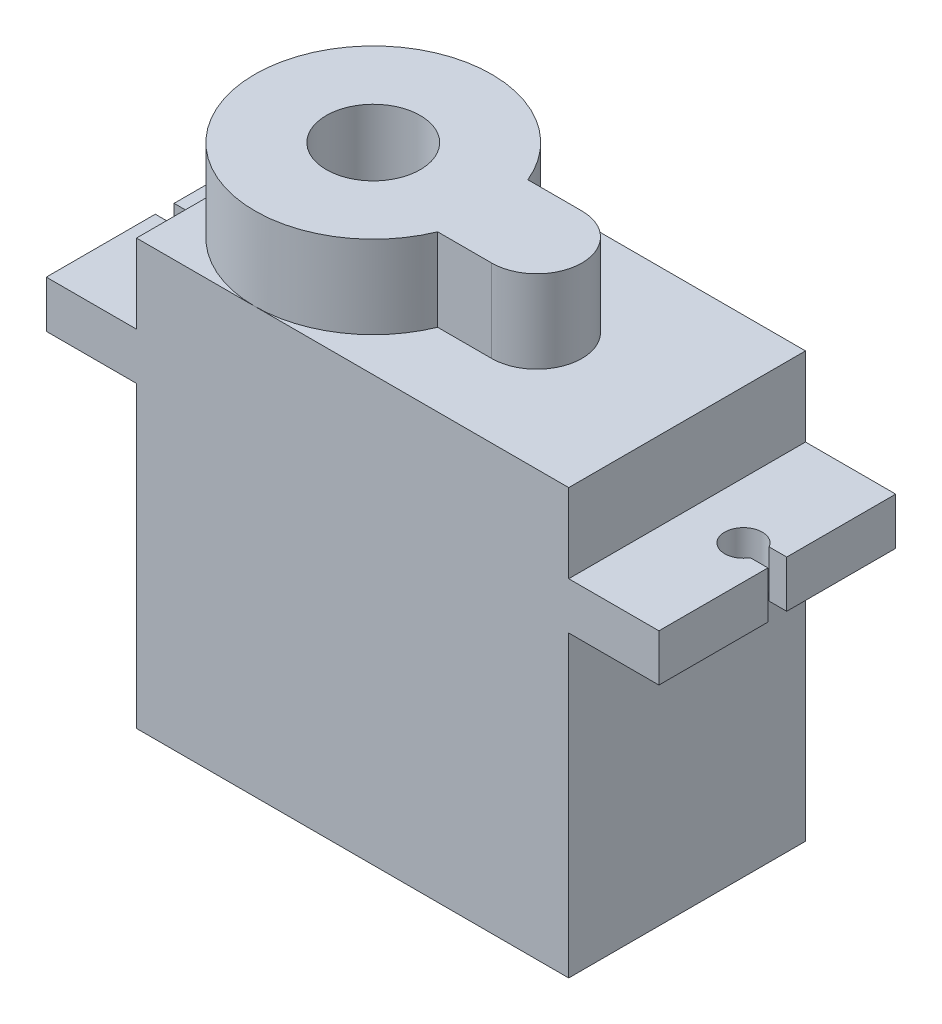
ISO-10303-21;
HEADER;
FILE_DESCRIPTION(('STEP AP214'),'2;1');
FILE_NAME('part.step','',(''),(''),'','','');
FILE_SCHEMA(('AUTOMOTIVE_DESIGN { 1 0 10303 214 1 1 1 1 }'));
ENDSEC;
DATA;
#1=APPLICATION_CONTEXT('core data for automotive mechanical design processes');
#2=APPLICATION_PROTOCOL_DEFINITION('international standard','automotive_design',2000,#1);
#3=PRODUCT_CONTEXT('',#1,'mechanical');
#4=PRODUCT('Part','Part','',(#3));
#5=PRODUCT_RELATED_PRODUCT_CATEGORY('part','',(#4));
#6=PRODUCT_DEFINITION_FORMATION('','',#4);
#7=PRODUCT_DEFINITION_CONTEXT('part definition',#1,'design');
#8=PRODUCT_DEFINITION('design','',#6,#7);
#9=PRODUCT_DEFINITION_SHAPE('','',#8);
#10=(LENGTH_UNIT() NAMED_UNIT(*) SI_UNIT(.MILLI.,.METRE.));
#11=(NAMED_UNIT(*) PLANE_ANGLE_UNIT() SI_UNIT($,.RADIAN.));
#12=(NAMED_UNIT(*) SI_UNIT($,.STERADIAN.) SOLID_ANGLE_UNIT());
#13=UNCERTAINTY_MEASURE_WITH_UNIT(LENGTH_MEASURE(1.E-05),#10,'distance_accuracy_value','');
#14=(GEOMETRIC_REPRESENTATION_CONTEXT(3) GLOBAL_UNCERTAINTY_ASSIGNED_CONTEXT((#13)) GLOBAL_UNIT_ASSIGNED_CONTEXT((#10,
#11,#12)) REPRESENTATION_CONTEXT('',''));
#15=CARTESIAN_POINT('',(0.,0.,0.));
#16=DIRECTION('',(0.,0.,1.));
#17=DIRECTION('',(1.,0.,0.));
#18=AXIS2_PLACEMENT_3D('',#15,#16,#17);
#19=CARTESIAN_POINT('',(-11.5,22.6,12.6));
#20=DIRECTION('',(0.,1.,0.));
#21=DIRECTION('',(0.,0.,1.));
#22=AXIS2_PLACEMENT_3D('',#19,#20,#21);
#23=PLANE('',#22);
#24=CARTESIAN_POINT('',(-5.2,22.6,6.3));
#25=DIRECTION('',(0.,1.,0.));
#26=DIRECTION('',(0.,0.,1.));
#27=AXIS2_PLACEMENT_3D('',#24,#25,#26);
#28=CIRCLE('',#27,6.3);
#29=CARTESIAN_POINT('',(0.62494635168428,22.6,3.9));
#30=VERTEX_POINT('',#29);
#31=CARTESIAN_POINT('',(-5.2,22.6,0.));
#32=VERTEX_POINT('',#31);
#33=EDGE_CURVE('E61',#30,#32,#28,.T.);
#34=ORIENTED_EDGE('',*,*,#33,.F.);
#35=DIRECTION('',(1.,0.,0.));
#36=VECTOR('',#35,1.);
#37=CARTESIAN_POINT('',(0.,22.6,3.9));
#38=LINE('',#37,#36);
#39=CARTESIAN_POINT('',(3.49999999999999,22.6,3.9));
#40=VERTEX_POINT('',#39);
#41=EDGE_CURVE('E72',#30,#40,#38,.T.);
#42=ORIENTED_EDGE('',*,*,#41,.T.);
#43=CARTESIAN_POINT('',(3.49999999999999,22.6,6.3));
#44=DIRECTION('',(0.,1.,0.));
#45=DIRECTION('',(0.,0.,1.));
#46=AXIS2_PLACEMENT_3D('',#43,#44,#45);
#47=CIRCLE('',#46,2.4);
#48=CARTESIAN_POINT('',(3.49999999999999,22.6,8.7));
#49=VERTEX_POINT('',#48);
#50=EDGE_CURVE('E458',#49,#40,#47,.T.);
#51=ORIENTED_EDGE('',*,*,#50,.F.);
#52=DIRECTION('',(1.,0.,0.));
#53=VECTOR('',#52,1.);
#54=CARTESIAN_POINT('',(0.,22.6,8.7));
#55=LINE('',#54,#53);
#56=CARTESIAN_POINT('',(0.62494635168428,22.6,8.7));
#57=VERTEX_POINT('',#56);
#58=EDGE_CURVE('E457',#57,#49,#55,.T.);
#59=ORIENTED_EDGE('',*,*,#58,.F.);
#60=CARTESIAN_POINT('',(-5.2,22.6,12.6));
#61=VERTEX_POINT('',#60);
#62=EDGE_CURVE('E247',#61,#57,#28,.T.);
#63=ORIENTED_EDGE('',*,*,#62,.F.);
#64=DIRECTION('',(1.,0.,0.));
#65=VECTOR('',#64,1.);
#66=CARTESIAN_POINT('',(-11.5,22.6,12.6));
#67=LINE('',#66,#65);
#68=CARTESIAN_POINT('',(11.5,22.6,12.6));
#69=VERTEX_POINT('',#68);
#70=EDGE_CURVE('E325',#61,#69,#67,.T.);
#71=ORIENTED_EDGE('',*,*,#70,.T.);
#72=DIRECTION('',(0.,0.,-1.));
#73=VECTOR('',#72,1.);
#74=CARTESIAN_POINT('',(11.5,22.6,12.6));
#75=LINE('',#74,#73);
#76=CARTESIAN_POINT('',(11.5,22.6,0.));
#77=VERTEX_POINT('',#76);
#78=EDGE_CURVE('E389',#69,#77,#75,.T.);
#79=ORIENTED_EDGE('',*,*,#78,.T.);
#80=DIRECTION('',(1.,0.,0.));
#81=VECTOR('',#80,1.);
#82=CARTESIAN_POINT('',(-11.5,22.6,0.));
#83=LINE('',#82,#81);
#84=EDGE_CURVE('E357',#32,#77,#83,.T.);
#85=ORIENTED_EDGE('',*,*,#84,.F.);
#86=EDGE_LOOP('',(#34,#42,#51,#59,#63,#71,#79,#85));
#87=FACE_BOUND('',#86,.T.);
#88=ADVANCED_FACE('F50',(#87),#23,.T.);
#89=CARTESIAN_POINT('',(-11.5,22.6,6.3));
#90=VERTEX_POINT('',#89);
#91=EDGE_CURVE('E13',#32,#90,#28,.T.);
#92=ORIENTED_EDGE('',*,*,#91,.F.);
#93=CARTESIAN_POINT('',(-11.5,22.6,0.));
#94=VERTEX_POINT('',#93);
#95=EDGE_CURVE('E358',#94,#32,#83,.T.);
#96=ORIENTED_EDGE('',*,*,#95,.F.);
#97=DIRECTION('',(0.,0.,-1.));
#98=VECTOR('',#97,1.);
#99=CARTESIAN_POINT('',(-11.5,22.6,12.6));
#100=LINE('',#99,#98);
#101=EDGE_CURVE('E395',#90,#94,#100,.T.);
#102=ORIENTED_EDGE('',*,*,#101,.F.);
#103=EDGE_LOOP('',(#92,#96,#102));
#104=FACE_BOUND('',#103,.T.);
#105=ADVANCED_FACE('F464',(#104),#23,.T.);
#106=CARTESIAN_POINT('',(-16.3,18.4,12.6));
#107=DIRECTION('',(0.,1.,0.));
#108=DIRECTION('',(0.,0.,1.));
#109=AXIS2_PLACEMENT_3D('',#106,#107,#108);
#110=PLANE('',#109);
#111=DIRECTION('',(1.,0.,0.));
#112=VECTOR('',#111,1.);
#113=CARTESIAN_POINT('',(0.,18.4,6.8));
#114=LINE('',#113,#112);
#115=CARTESIAN_POINT('',(-16.3,18.4,6.8));
#116=VERTEX_POINT('',#115);
#117=CARTESIAN_POINT('',(-15.3660254037844,18.4,6.8));
#118=VERTEX_POINT('',#117);
#119=EDGE_CURVE('E248',#116,#118,#114,.T.);
#120=ORIENTED_EDGE('',*,*,#119,.F.);
#121=DIRECTION('',(0.,0.,-1.));
#122=VECTOR('',#121,1.);
#123=CARTESIAN_POINT('',(-16.3,18.4,12.6));
#124=LINE('',#123,#122);
#125=CARTESIAN_POINT('',(-16.3,18.4,12.6));
#126=VERTEX_POINT('',#125);
#127=EDGE_CURVE('E398',#126,#116,#124,.T.);
#128=ORIENTED_EDGE('',*,*,#127,.F.);
#129=DIRECTION('',(1.,0.,0.));
#130=VECTOR('',#129,1.);
#131=CARTESIAN_POINT('',(-16.3,18.4,12.6));
#132=LINE('',#131,#130);
#133=CARTESIAN_POINT('',(-11.5,18.4,12.6));
#134=VERTEX_POINT('',#133);
#135=EDGE_CURVE('E319',#126,#134,#132,.T.);
#136=ORIENTED_EDGE('',*,*,#135,.T.);
#137=DIRECTION('',(0.,0.,-1.));
#138=VECTOR('',#137,1.);
#139=CARTESIAN_POINT('',(-11.5,18.4,12.6));
#140=LINE('',#139,#138);
#141=CARTESIAN_POINT('',(-11.5,18.4,0.));
#142=VERTEX_POINT('',#141);
#143=EDGE_CURVE('E396',#134,#142,#140,.T.);
#144=ORIENTED_EDGE('',*,*,#143,.T.);
#145=DIRECTION('',(1.,0.,0.));
#146=VECTOR('',#145,1.);
#147=CARTESIAN_POINT('',(-16.3,18.4,0.));
#148=LINE('',#147,#146);
#149=CARTESIAN_POINT('',(-16.3,18.4,0.));
#150=VERTEX_POINT('',#149);
#151=EDGE_CURVE('E351',#150,#142,#148,.T.);
#152=ORIENTED_EDGE('',*,*,#151,.F.);
#153=CARTESIAN_POINT('',(-16.3,18.4,5.8));
#154=VERTEX_POINT('',#153);
#155=EDGE_CURVE('E401',#154,#150,#124,.T.);
#156=ORIENTED_EDGE('',*,*,#155,.F.);
#157=DIRECTION('',(1.,0.,0.));
#158=VECTOR('',#157,1.);
#159=CARTESIAN_POINT('',(0.,18.4,5.8));
#160=LINE('',#159,#158);
#161=CARTESIAN_POINT('',(-15.3660254037844,18.4,5.8));
#162=VERTEX_POINT('',#161);
#163=EDGE_CURVE('E261',#154,#162,#160,.T.);
#164=ORIENTED_EDGE('',*,*,#163,.T.);
#165=CARTESIAN_POINT('',(-14.5,18.4,6.3));
#166=DIRECTION('',(0.,1.,0.));
#167=DIRECTION('',(0.,0.,1.));
#168=AXIS2_PLACEMENT_3D('',#165,#166,#167);
#169=CIRCLE('',#168,1.);
#170=EDGE_CURVE('E251',#162,#118,#169,.F.);
#171=ORIENTED_EDGE('',*,*,#170,.T.);
#172=EDGE_LOOP('',(#120,#128,#136,#144,#152,#156,#164,#171));
#173=FACE_BOUND('',#172,.T.);
#174=ADVANCED_FACE('F447',(#173),#110,.T.);
#175=CARTESIAN_POINT('',(-16.3,15.9,12.6));
#176=DIRECTION('',(-1.,0.,0.));
#177=DIRECTION('',(0.,-1.,0.));
#178=AXIS2_PLACEMENT_3D('',#175,#176,#177);
#179=PLANE('',#178);
#180=DIRECTION('',(0.,0.,-1.));
#181=VECTOR('',#180,1.);
#182=CARTESIAN_POINT('',(-16.3,15.9,12.6));
#183=LINE('',#182,#181);
#184=CARTESIAN_POINT('',(-16.3,15.9,5.8));
#185=VERTEX_POINT('',#184);
#186=CARTESIAN_POINT('',(-16.3,15.9,0.));
#187=VERTEX_POINT('',#186);
#188=EDGE_CURVE('E404',#185,#187,#183,.T.);
#189=ORIENTED_EDGE('',*,*,#188,.F.);
#190=DIRECTION('',(0.,1.,0.));
#191=VECTOR('',#190,1.);
#192=CARTESIAN_POINT('',(-16.3,15.9,5.8));
#193=LINE('',#192,#191);
#194=EDGE_CURVE('E274',#185,#154,#193,.T.);
#195=ORIENTED_EDGE('',*,*,#194,.T.);
#196=ORIENTED_EDGE('',*,*,#155,.T.);
#197=DIRECTION('',(0.,1.,0.));
#198=VECTOR('',#197,1.);
#199=CARTESIAN_POINT('',(-16.3,15.9,0.));
#200=LINE('',#199,#198);
#201=EDGE_CURVE('E348',#187,#150,#200,.T.);
#202=ORIENTED_EDGE('',*,*,#201,.F.);
#203=EDGE_LOOP('',(#189,#195,#196,#202));
#204=FACE_BOUND('',#203,.T.);
#205=ADVANCED_FACE('F443',(#204),#179,.T.);
#206=CARTESIAN_POINT('',(-11.5,15.9,12.6));
#207=DIRECTION('',(0.,-1.,0.));
#208=DIRECTION('',(0.,0.,-1.));
#209=AXIS2_PLACEMENT_3D('',#206,#207,#208);
#210=PLANE('',#209);
#211=DIRECTION('',(1.,0.,0.));
#212=VECTOR('',#211,1.);
#213=CARTESIAN_POINT('',(0.,15.9,6.8));
#214=LINE('',#213,#212);
#215=CARTESIAN_POINT('',(-16.3,15.9,6.8));
#216=VERTEX_POINT('',#215);
#217=CARTESIAN_POINT('',(-15.3660254037844,15.9,6.8));
#218=VERTEX_POINT('',#217);
#219=EDGE_CURVE('E257',#216,#218,#214,.T.);
#220=ORIENTED_EDGE('',*,*,#219,.T.);
#221=CARTESIAN_POINT('',(-14.5,15.9,6.3));
#222=DIRECTION('',(0.,1.,0.));
#223=DIRECTION('',(0.,0.,1.));
#224=AXIS2_PLACEMENT_3D('',#221,#222,#223);
#225=CIRCLE('',#224,1.);
#226=CARTESIAN_POINT('',(-15.3660254037844,15.9,5.8));
#227=VERTEX_POINT('',#226);
#228=EDGE_CURVE('E260',#227,#218,#225,.F.);
#229=ORIENTED_EDGE('',*,*,#228,.F.);
#230=DIRECTION('',(1.,0.,0.));
#231=VECTOR('',#230,1.);
#232=CARTESIAN_POINT('',(0.,15.9,5.8));
#233=LINE('',#232,#231);
#234=EDGE_CURVE('E263',#185,#227,#233,.T.);
#235=ORIENTED_EDGE('',*,*,#234,.F.);
#236=ORIENTED_EDGE('',*,*,#188,.T.);
#237=DIRECTION('',(-1.,0.,0.));
#238=VECTOR('',#237,1.);
#239=CARTESIAN_POINT('',(-11.5,15.9,0.));
#240=LINE('',#239,#238);
#241=CARTESIAN_POINT('',(-11.5,15.9,0.));
#242=VERTEX_POINT('',#241);
#243=EDGE_CURVE('E345',#242,#187,#240,.T.);
#244=ORIENTED_EDGE('',*,*,#243,.F.);
#245=DIRECTION('',(0.,0.,-1.));
#246=VECTOR('',#245,1.);
#247=CARTESIAN_POINT('',(-11.5,15.9,12.6));
#248=LINE('',#247,#246);
#249=CARTESIAN_POINT('',(-11.5,15.9,12.6));
#250=VERTEX_POINT('',#249);
#251=EDGE_CURVE('E405',#250,#242,#248,.T.);
#252=ORIENTED_EDGE('',*,*,#251,.F.);
#253=DIRECTION('',(-1.,0.,0.));
#254=VECTOR('',#253,1.);
#255=CARTESIAN_POINT('',(-11.5,15.9,12.6));
#256=LINE('',#255,#254);
#257=CARTESIAN_POINT('',(-16.3,15.9,12.6));
#258=VERTEX_POINT('',#257);
#259=EDGE_CURVE('E313',#250,#258,#256,.T.);
#260=ORIENTED_EDGE('',*,*,#259,.T.);
#261=EDGE_CURVE('E402',#258,#216,#183,.T.);
#262=ORIENTED_EDGE('',*,*,#261,.T.);
#263=EDGE_LOOP('',(#220,#229,#235,#236,#244,#252,#260,#262));
#264=FACE_BOUND('',#263,.T.);
#265=ADVANCED_FACE('F437',(#264),#210,.T.);
#266=CARTESIAN_POINT('',(16.3,15.9,12.6));
#267=DIRECTION('',(-1.,0.,0.));
#268=DIRECTION('',(0.,-1.,0.));
#269=AXIS2_PLACEMENT_3D('',#266,#267,#268);
#270=PLANE('',#269);
#271=DIRECTION('',(0.,1.,0.));
#272=VECTOR('',#271,1.);
#273=CARTESIAN_POINT('',(16.3,15.9,6.8));
#274=LINE('',#273,#272);
#275=CARTESIAN_POINT('',(16.3,15.9,6.8));
#276=VERTEX_POINT('',#275);
#277=CARTESIAN_POINT('',(16.3,18.4,6.8));
#278=VERTEX_POINT('',#277);
#279=EDGE_CURVE('E299',#276,#278,#274,.T.);
#280=ORIENTED_EDGE('',*,*,#279,.T.);
#281=DIRECTION('',(0.,0.,-1.));
#282=VECTOR('',#281,1.);
#283=CARTESIAN_POINT('',(16.3,18.4,12.6));
#284=LINE('',#283,#282);
#285=CARTESIAN_POINT('',(16.3,18.4,12.6));
#286=VERTEX_POINT('',#285);
#287=EDGE_CURVE('E382',#286,#278,#284,.T.);
#288=ORIENTED_EDGE('',*,*,#287,.F.);
#289=DIRECTION('',(0.,1.,0.));
#290=VECTOR('',#289,1.);
#291=CARTESIAN_POINT('',(16.3,15.9,12.6));
#292=LINE('',#291,#290);
#293=CARTESIAN_POINT('',(16.3,15.9,12.6));
#294=VERTEX_POINT('',#293);
#295=EDGE_CURVE('E334',#294,#286,#292,.T.);
#296=ORIENTED_EDGE('',*,*,#295,.F.);
#297=DIRECTION('',(0.,0.,-1.));
#298=VECTOR('',#297,1.);
#299=CARTESIAN_POINT('',(16.3,15.9,12.6));
#300=LINE('',#299,#298);
#301=EDGE_CURVE('E378',#294,#276,#300,.T.);
#302=ORIENTED_EDGE('',*,*,#301,.T.);
#303=EDGE_LOOP('',(#280,#288,#296,#302));
#304=FACE_BOUND('',#303,.T.);
#305=ADVANCED_FACE('F668',(#304),#270,.F.);
#306=CARTESIAN_POINT('',(11.5,0.,12.6));
#307=DIRECTION('',(0.,-1.,0.));
#308=DIRECTION('',(0.,0.,-1.));
#309=AXIS2_PLACEMENT_3D('',#306,#307,#308);
#310=PLANE('',#309);
#311=DIRECTION('',(-1.,0.,0.));
#312=VECTOR('',#311,1.);
#313=CARTESIAN_POINT('',(11.5,0.,0.));
#314=LINE('',#313,#312);
#315=CARTESIAN_POINT('',(11.5,0.,0.));
#316=VERTEX_POINT('',#315);
#317=CARTESIAN_POINT('',(-11.5,0.,0.));
#318=VERTEX_POINT('',#317);
#319=EDGE_CURVE('E298',#316,#318,#314,.T.);
#320=ORIENTED_EDGE('',*,*,#319,.F.);
#321=DIRECTION('',(0.,0.,-1.));
#322=VECTOR('',#321,1.);
#323=CARTESIAN_POINT('',(11.5,0.,12.6));
#324=LINE('',#323,#322);
#325=CARTESIAN_POINT('',(11.5,0.,12.6));
#326=VERTEX_POINT('',#325);
#327=EDGE_CURVE('E373',#326,#316,#324,.T.);
#328=ORIENTED_EDGE('',*,*,#327,.F.);
#329=DIRECTION('',(-1.,0.,0.));
#330=VECTOR('',#329,1.);
#331=CARTESIAN_POINT('',(11.5,0.,12.6));
#332=LINE('',#331,#330);
#333=CARTESIAN_POINT('',(-11.5,0.,12.6));
#334=VERTEX_POINT('',#333);
#335=EDGE_CURVE('E306',#326,#334,#332,.T.);
#336=ORIENTED_EDGE('',*,*,#335,.T.);
#337=DIRECTION('',(0.,0.,-1.));
#338=VECTOR('',#337,1.);
#339=CARTESIAN_POINT('',(-11.5,0.,12.6));
#340=LINE('',#339,#338);
#341=EDGE_CURVE('E54',#334,#318,#340,.T.);
#342=ORIENTED_EDGE('',*,*,#341,.T.);
#343=EDGE_LOOP('',(#320,#328,#336,#342));
#344=FACE_BOUND('',#343,.T.);
#345=ADVANCED_FACE('F52',(#344),#310,.T.);
#346=CARTESIAN_POINT('',(11.5,0.,12.6));
#347=DIRECTION('',(-1.,0.,0.));
#348=DIRECTION('',(0.,0.,1.));
#349=AXIS2_PLACEMENT_3D('',#346,#347,#348);
#350=PLANE('',#349);
#351=DIRECTION('',(0.,1.,0.));
#352=VECTOR('',#351,1.);
#353=CARTESIAN_POINT('',(11.5,0.,0.));
#354=LINE('',#353,#352);
#355=CARTESIAN_POINT('',(11.5,15.9,0.));
#356=VERTEX_POINT('',#355);
#357=EDGE_CURVE('E310',#316,#356,#354,.T.);
#358=ORIENTED_EDGE('',*,*,#357,.T.);
#359=DIRECTION('',(0.,0.,-1.));
#360=VECTOR('',#359,1.);
#361=CARTESIAN_POINT('',(11.5,15.9,12.6));
#362=LINE('',#361,#360);
#363=CARTESIAN_POINT('',(11.5,15.9,12.6));
#364=VERTEX_POINT('',#363);
#365=EDGE_CURVE('E375',#364,#356,#362,.T.);
#366=ORIENTED_EDGE('',*,*,#365,.F.);
#367=DIRECTION('',(0.,1.,0.));
#368=VECTOR('',#367,1.);
#369=CARTESIAN_POINT('',(11.5,0.,12.6));
#370=LINE('',#369,#368);
#371=EDGE_CURVE('E338',#326,#364,#370,.T.);
#372=ORIENTED_EDGE('',*,*,#371,.F.);
#373=ORIENTED_EDGE('',*,*,#327,.T.);
#374=EDGE_LOOP('',(#358,#366,#372,#373));
#375=FACE_BOUND('',#374,.T.);
#376=ADVANCED_FACE('F421',(#375),#350,.F.);
#377=CARTESIAN_POINT('',(11.5,15.9,12.6));
#378=DIRECTION('',(0.,1.,0.));
#379=DIRECTION('',(0.,0.,1.));
#380=AXIS2_PLACEMENT_3D('',#377,#378,#379);
#381=PLANE('',#380);
#382=CARTESIAN_POINT('',(16.3,15.9,5.8));
#383=VERTEX_POINT('',#382);
#384=CARTESIAN_POINT('',(16.3,15.9,0.));
#385=VERTEX_POINT('',#384);
#386=EDGE_CURVE('E381',#383,#385,#300,.T.);
#387=ORIENTED_EDGE('',*,*,#386,.F.);
#388=DIRECTION('',(-1.,0.,0.));
#389=VECTOR('',#388,1.);
#390=CARTESIAN_POINT('',(0.,15.9,5.79999999999994));
#391=LINE('',#390,#389);
#392=CARTESIAN_POINT('',(15.3660254037844,15.9,5.79999999999999));
#393=VERTEX_POINT('',#392);
#394=EDGE_CURVE('E280',#383,#393,#391,.T.);
#395=ORIENTED_EDGE('',*,*,#394,.T.);
#396=CARTESIAN_POINT('',(14.5,15.9,6.29999999999999));
#397=DIRECTION('',(0.,1.,0.));
#398=DIRECTION('',(0.,0.,1.));
#399=AXIS2_PLACEMENT_3D('',#396,#397,#398);
#400=CIRCLE('',#399,1.);
#401=CARTESIAN_POINT('',(15.3660254037844,15.9,6.8));
#402=VERTEX_POINT('',#401);
#403=EDGE_CURVE('E283',#393,#402,#400,.T.);
#404=ORIENTED_EDGE('',*,*,#403,.T.);
#405=DIRECTION('',(-1.,0.,0.));
#406=VECTOR('',#405,1.);
#407=CARTESIAN_POINT('',(0.,15.9,6.80000000000006));
#408=LINE('',#407,#406);
#409=EDGE_CURVE('E287',#276,#402,#408,.T.);
#410=ORIENTED_EDGE('',*,*,#409,.F.);
#411=ORIENTED_EDGE('',*,*,#301,.F.);
#412=DIRECTION('',(1.,0.,0.));
#413=VECTOR('',#412,1.);
#414=CARTESIAN_POINT('',(11.5,15.9,12.6));
#415=LINE('',#414,#413);
#416=EDGE_CURVE('E336',#364,#294,#415,.T.);
#417=ORIENTED_EDGE('',*,*,#416,.F.);
#418=ORIENTED_EDGE('',*,*,#365,.T.);
#419=DIRECTION('',(1.,0.,0.));
#420=VECTOR('',#419,1.);
#421=CARTESIAN_POINT('',(11.5,15.9,0.));
#422=LINE('',#421,#420);
#423=EDGE_CURVE('E369',#356,#385,#422,.T.);
#424=ORIENTED_EDGE('',*,*,#423,.T.);
#425=EDGE_LOOP('',(#387,#395,#404,#410,#411,#417,#418,#424));
#426=FACE_BOUND('',#425,.T.);
#427=ADVANCED_FACE('F426',(#426),#381,.F.);
#428=CARTESIAN_POINT('',(16.3,18.4,5.8));
#429=VERTEX_POINT('',#428);
#430=CARTESIAN_POINT('',(16.3,18.4,0.));
#431=VERTEX_POINT('',#430);
#432=EDGE_CURVE('E385',#429,#431,#284,.T.);
#433=ORIENTED_EDGE('',*,*,#432,.F.);
#434=DIRECTION('',(0.,1.,0.));
#435=VECTOR('',#434,1.);
#436=CARTESIAN_POINT('',(16.3,15.9,5.8));
#437=LINE('',#436,#435);
#438=EDGE_CURVE('E296',#383,#429,#437,.T.);
#439=ORIENTED_EDGE('',*,*,#438,.F.);
#440=ORIENTED_EDGE('',*,*,#386,.T.);
#441=DIRECTION('',(0.,1.,0.));
#442=VECTOR('',#441,1.);
#443=CARTESIAN_POINT('',(16.3,15.9,0.));
#444=LINE('',#443,#442);
#445=EDGE_CURVE('E366',#385,#431,#444,.T.);
#446=ORIENTED_EDGE('',*,*,#445,.T.);
#447=EDGE_LOOP('',(#433,#439,#440,#446));
#448=FACE_BOUND('',#447,.T.);
#449=ADVANCED_FACE('F656',(#448),#270,.F.);
#450=CARTESIAN_POINT('',(16.3,18.4,12.6));
#451=DIRECTION('',(0.,-1.,0.));
#452=DIRECTION('',(0.,0.,-1.));
#453=AXIS2_PLACEMENT_3D('',#450,#451,#452);
#454=PLANE('',#453);
#455=CARTESIAN_POINT('',(14.5,18.4,6.29999999999999));
#456=DIRECTION('',(0.,1.,0.));
#457=DIRECTION('',(0.,0.,1.));
#458=AXIS2_PLACEMENT_3D('',#455,#456,#457);
#459=CIRCLE('',#458,1.);
#460=CARTESIAN_POINT('',(15.3660254037844,18.4,5.79999999999999));
#461=VERTEX_POINT('',#460);
#462=CARTESIAN_POINT('',(15.3660254037844,18.4,6.8));
#463=VERTEX_POINT('',#462);
#464=EDGE_CURVE('E291',#461,#463,#459,.T.);
#465=ORIENTED_EDGE('',*,*,#464,.F.);
#466=DIRECTION('',(-1.,0.,0.));
#467=VECTOR('',#466,1.);
#468=CARTESIAN_POINT('',(0.,18.4,5.79999999999994));
#469=LINE('',#468,#467);
#470=EDGE_CURVE('E273',#429,#461,#469,.T.);
#471=ORIENTED_EDGE('',*,*,#470,.F.);
#472=ORIENTED_EDGE('',*,*,#432,.T.);
#473=DIRECTION('',(-1.,0.,0.));
#474=VECTOR('',#473,1.);
#475=CARTESIAN_POINT('',(16.3,18.4,0.));
#476=LINE('',#475,#474);
#477=CARTESIAN_POINT('',(11.5,18.4,0.));
#478=VERTEX_POINT('',#477);
#479=EDGE_CURVE('E364',#431,#478,#476,.T.);
#480=ORIENTED_EDGE('',*,*,#479,.T.);
#481=DIRECTION('',(0.,0.,-1.));
#482=VECTOR('',#481,1.);
#483=CARTESIAN_POINT('',(11.5,18.4,12.6));
#484=LINE('',#483,#482);
#485=CARTESIAN_POINT('',(11.5,18.4,12.6));
#486=VERTEX_POINT('',#485);
#487=EDGE_CURVE('E386',#486,#478,#484,.T.);
#488=ORIENTED_EDGE('',*,*,#487,.F.);
#489=DIRECTION('',(-1.,0.,0.));
#490=VECTOR('',#489,1.);
#491=CARTESIAN_POINT('',(16.3,18.4,12.6));
#492=LINE('',#491,#490);
#493=EDGE_CURVE('E332',#286,#486,#492,.T.);
#494=ORIENTED_EDGE('',*,*,#493,.F.);
#495=ORIENTED_EDGE('',*,*,#287,.T.);
#496=DIRECTION('',(-1.,0.,0.));
#497=VECTOR('',#496,1.);
#498=CARTESIAN_POINT('',(0.,18.4,6.80000000000006));
#499=LINE('',#498,#497);
#500=EDGE_CURVE('E284',#278,#463,#499,.T.);
#501=ORIENTED_EDGE('',*,*,#500,.T.);
#502=EDGE_LOOP('',(#465,#471,#472,#480,#488,#494,#495,#501));
#503=FACE_BOUND('',#502,.T.);
#504=ADVANCED_FACE('F512',(#503),#454,.F.);
#505=CARTESIAN_POINT('',(11.5,18.4,12.6));
#506=DIRECTION('',(-1.,0.,0.));
#507=DIRECTION('',(0.,0.,1.));
#508=AXIS2_PLACEMENT_3D('',#505,#506,#507);
#509=PLANE('',#508);
#510=DIRECTION('',(0.,1.,0.));
#511=VECTOR('',#510,1.);
#512=CARTESIAN_POINT('',(11.5,18.4,0.));
#513=LINE('',#512,#511);
#514=EDGE_CURVE('E361',#478,#77,#513,.T.);
#515=ORIENTED_EDGE('',*,*,#514,.T.);
#516=ORIENTED_EDGE('',*,*,#78,.F.);
#517=DIRECTION('',(0.,1.,0.));
#518=VECTOR('',#517,1.);
#519=CARTESIAN_POINT('',(11.5,18.4,12.6));
#520=LINE('',#519,#518);
#521=EDGE_CURVE('E329',#486,#69,#520,.T.);
#522=ORIENTED_EDGE('',*,*,#521,.F.);
#523=ORIENTED_EDGE('',*,*,#487,.T.);
#524=EDGE_LOOP('',(#515,#516,#522,#523));
#525=FACE_BOUND('',#524,.T.);
#526=ADVANCED_FACE('F506',(#525),#509,.F.);
#527=EDGE_CURVE('E59',#90,#61,#28,.T.);
#528=ORIENTED_EDGE('',*,*,#527,.F.);
#529=CARTESIAN_POINT('',(-11.5,22.6,12.6));
#530=VERTEX_POINT('',#529);
#531=EDGE_CURVE('E392',#530,#90,#100,.T.);
#532=ORIENTED_EDGE('',*,*,#531,.F.);
#533=EDGE_CURVE('E326',#530,#61,#67,.T.);
#534=ORIENTED_EDGE('',*,*,#533,.T.);
#535=EDGE_LOOP('',(#528,#532,#534));
#536=FACE_BOUND('',#535,.T.);
#537=ADVANCED_FACE('F462',(#536),#23,.T.);
#538=CARTESIAN_POINT('',(-11.5,18.4,12.6));
#539=DIRECTION('',(-1.,0.,0.));
#540=DIRECTION('',(0.,0.,1.));
#541=AXIS2_PLACEMENT_3D('',#538,#539,#540);
#542=PLANE('',#541);
#543=DIRECTION('',(0.,1.,0.));
#544=VECTOR('',#543,1.);
#545=CARTESIAN_POINT('',(-11.5,18.4,0.));
#546=LINE('',#545,#544);
#547=EDGE_CURVE('E354',#142,#94,#546,.T.);
#548=ORIENTED_EDGE('',*,*,#547,.F.);
#549=ORIENTED_EDGE('',*,*,#143,.F.);
#550=DIRECTION('',(0.,1.,0.));
#551=VECTOR('',#550,1.);
#552=CARTESIAN_POINT('',(-11.5,18.4,12.6));
#553=LINE('',#552,#551);
#554=EDGE_CURVE('E322',#134,#530,#553,.T.);
#555=ORIENTED_EDGE('',*,*,#554,.T.);
#556=ORIENTED_EDGE('',*,*,#531,.T.);
#557=ORIENTED_EDGE('',*,*,#101,.T.);
#558=EDGE_LOOP('',(#548,#549,#555,#556,#557));
#559=FACE_BOUND('',#558,.T.);
#560=ADVANCED_FACE('F451',(#559),#542,.T.);
#561=DIRECTION('',(0.,1.,0.));
#562=VECTOR('',#561,1.);
#563=CARTESIAN_POINT('',(-16.3,15.9,6.8));
#564=LINE('',#563,#562);
#565=EDGE_CURVE('E271',#216,#116,#564,.T.);
#566=ORIENTED_EDGE('',*,*,#565,.F.);
#567=ORIENTED_EDGE('',*,*,#261,.F.);
#568=DIRECTION('',(0.,1.,0.));
#569=VECTOR('',#568,1.);
#570=CARTESIAN_POINT('',(-16.3,15.9,12.6));
#571=LINE('',#570,#569);
#572=EDGE_CURVE('E316',#258,#126,#571,.T.);
#573=ORIENTED_EDGE('',*,*,#572,.T.);
#574=ORIENTED_EDGE('',*,*,#127,.T.);
#575=EDGE_LOOP('',(#566,#567,#573,#574));
#576=FACE_BOUND('',#575,.T.);
#577=ADVANCED_FACE('F511',(#576),#179,.T.);
#578=CARTESIAN_POINT('',(-11.5,0.,12.6));
#579=DIRECTION('',(-1.,0.,0.));
#580=DIRECTION('',(0.,0.,1.));
#581=AXIS2_PLACEMENT_3D('',#578,#579,#580);
#582=PLANE('',#581);
#583=DIRECTION('',(0.,1.,0.));
#584=VECTOR('',#583,1.);
#585=CARTESIAN_POINT('',(-11.5,0.,0.));
#586=LINE('',#585,#584);
#587=EDGE_CURVE('E342',#318,#242,#586,.T.);
#588=ORIENTED_EDGE('',*,*,#587,.F.);
#589=ORIENTED_EDGE('',*,*,#341,.F.);
#590=DIRECTION('',(0.,1.,0.));
#591=VECTOR('',#590,1.);
#592=CARTESIAN_POINT('',(-11.5,0.,12.6));
#593=LINE('',#592,#591);
#594=EDGE_CURVE('E309',#334,#250,#593,.T.);
#595=ORIENTED_EDGE('',*,*,#594,.T.);
#596=ORIENTED_EDGE('',*,*,#251,.T.);
#597=EDGE_LOOP('',(#588,#589,#595,#596));
#598=FACE_BOUND('',#597,.T.);
#599=ADVANCED_FACE('F413',(#598),#582,.T.);
#600=CARTESIAN_POINT('',(0.,0.,12.6));
#601=DIRECTION('',(0.,0.,-1.));
#602=DIRECTION('',(-1.,0.,0.));
#603=AXIS2_PLACEMENT_3D('',#600,#601,#602);
#604=PLANE('',#603);
#605=ORIENTED_EDGE('',*,*,#335,.F.);
#606=ORIENTED_EDGE('',*,*,#371,.T.);
#607=ORIENTED_EDGE('',*,*,#416,.T.);
#608=ORIENTED_EDGE('',*,*,#295,.T.);
#609=ORIENTED_EDGE('',*,*,#493,.T.);
#610=ORIENTED_EDGE('',*,*,#521,.T.);
#611=ORIENTED_EDGE('',*,*,#70,.F.);
#612=ORIENTED_EDGE('',*,*,#533,.F.);
#613=ORIENTED_EDGE('',*,*,#554,.F.);
#614=ORIENTED_EDGE('',*,*,#135,.F.);
#615=ORIENTED_EDGE('',*,*,#572,.F.);
#616=ORIENTED_EDGE('',*,*,#259,.F.);
#617=ORIENTED_EDGE('',*,*,#594,.F.);
#618=EDGE_LOOP('',(#605,#606,#607,#608,#609,#610,#611,#612,#613,#614,#615,#616,#617));
#619=FACE_BOUND('',#618,.T.);
#620=ADVANCED_FACE('F431',(#619),#604,.F.);
#621=CARTESIAN_POINT('',(0.,0.,0.));
#622=DIRECTION('',(0.,0.,-1.));
#623=DIRECTION('',(-1.,0.,0.));
#624=AXIS2_PLACEMENT_3D('',#621,#622,#623);
#625=PLANE('',#624);
#626=ORIENTED_EDGE('',*,*,#319,.T.);
#627=ORIENTED_EDGE('',*,*,#587,.T.);
#628=ORIENTED_EDGE('',*,*,#243,.T.);
#629=ORIENTED_EDGE('',*,*,#201,.T.);
#630=ORIENTED_EDGE('',*,*,#151,.T.);
#631=ORIENTED_EDGE('',*,*,#547,.T.);
#632=ORIENTED_EDGE('',*,*,#95,.T.);
#633=ORIENTED_EDGE('',*,*,#84,.T.);
#634=ORIENTED_EDGE('',*,*,#514,.F.);
#635=ORIENTED_EDGE('',*,*,#479,.F.);
#636=ORIENTED_EDGE('',*,*,#445,.F.);
#637=ORIENTED_EDGE('',*,*,#423,.F.);
#638=ORIENTED_EDGE('',*,*,#357,.F.);
#639=EDGE_LOOP('',(#626,#627,#628,#629,#630,#631,#632,#633,#634,#635,#636,#637,#638));
#640=FACE_BOUND('',#639,.T.);
#641=ADVANCED_FACE('F416',(#640),#625,.T.);
#642=CARTESIAN_POINT('',(0.,15.9,5.79999999999994));
#643=DIRECTION('',(0.,0.,-1.));
#644=DIRECTION('',(-1.,0.,0.));
#645=AXIS2_PLACEMENT_3D('',#642,#643,#644);
#646=PLANE('',#645);
#647=ORIENTED_EDGE('',*,*,#470,.T.);
#648=DIRECTION('',(0.,1.,0.));
#649=VECTOR('',#648,1.);
#650=CARTESIAN_POINT('',(15.3660254037844,15.9,5.79999999999999));
#651=LINE('',#650,#649);
#652=EDGE_CURVE('E289',#393,#461,#651,.T.);
#653=ORIENTED_EDGE('',*,*,#652,.F.);
#654=ORIENTED_EDGE('',*,*,#394,.F.);
#655=ORIENTED_EDGE('',*,*,#438,.T.);
#656=EDGE_LOOP('',(#647,#653,#654,#655));
#657=FACE_BOUND('',#656,.T.);
#658=ADVANCED_FACE('F530',(#657),#646,.F.);
#659=CARTESIAN_POINT('',(0.,15.9,6.80000000000006));
#660=DIRECTION('',(0.,0.,-1.));
#661=DIRECTION('',(-1.,0.,0.));
#662=AXIS2_PLACEMENT_3D('',#659,#660,#661);
#663=PLANE('',#662);
#664=ORIENTED_EDGE('',*,*,#500,.F.);
#665=ORIENTED_EDGE('',*,*,#279,.F.);
#666=ORIENTED_EDGE('',*,*,#409,.T.);
#667=DIRECTION('',(0.,1.,0.));
#668=VECTOR('',#667,1.);
#669=CARTESIAN_POINT('',(15.3660254037844,15.9,6.8));
#670=LINE('',#669,#668);
#671=EDGE_CURVE('E302',#402,#463,#670,.T.);
#672=ORIENTED_EDGE('',*,*,#671,.T.);
#673=EDGE_LOOP('',(#664,#665,#666,#672));
#674=FACE_BOUND('',#673,.T.);
#675=ADVANCED_FACE('F597',(#674),#663,.T.);
#676=CARTESIAN_POINT('',(14.5,15.9,6.29999999999999));
#677=DIRECTION('',(0.,1.,0.));
#678=DIRECTION('',(0.,0.,1.));
#679=AXIS2_PLACEMENT_3D('',#676,#677,#678);
#680=CYLINDRICAL_SURFACE('',#679,1.);
#681=ORIENTED_EDGE('',*,*,#464,.T.);
#682=ORIENTED_EDGE('',*,*,#671,.F.);
#683=ORIENTED_EDGE('',*,*,#403,.F.);
#684=ORIENTED_EDGE('',*,*,#652,.T.);
#685=EDGE_LOOP('',(#681,#682,#683,#684));
#686=FACE_BOUND('',#685,.T.);
#687=ADVANCED_FACE('F589',(#686),#680,.F.);
#688=CARTESIAN_POINT('',(0.,15.9,6.8));
#689=DIRECTION('',(0.,0.,1.));
#690=DIRECTION('',(1.,0.,0.));
#691=AXIS2_PLACEMENT_3D('',#688,#689,#690);
#692=PLANE('',#691);
#693=ORIENTED_EDGE('',*,*,#119,.T.);
#694=DIRECTION('',(0.,1.,0.));
#695=VECTOR('',#694,1.);
#696=CARTESIAN_POINT('',(-15.3660254037844,15.9,6.8));
#697=LINE('',#696,#695);
#698=EDGE_CURVE('E265',#218,#118,#697,.T.);
#699=ORIENTED_EDGE('',*,*,#698,.F.);
#700=ORIENTED_EDGE('',*,*,#219,.F.);
#701=ORIENTED_EDGE('',*,*,#565,.T.);
#702=EDGE_LOOP('',(#693,#699,#700,#701));
#703=FACE_BOUND('',#702,.T.);
#704=ADVANCED_FACE('F581',(#703),#692,.F.);
#705=CARTESIAN_POINT('',(0.,15.9,5.8));
#706=DIRECTION('',(0.,0.,1.));
#707=DIRECTION('',(1.,0.,0.));
#708=AXIS2_PLACEMENT_3D('',#705,#706,#707);
#709=PLANE('',#708);
#710=ORIENTED_EDGE('',*,*,#163,.F.);
#711=ORIENTED_EDGE('',*,*,#194,.F.);
#712=ORIENTED_EDGE('',*,*,#234,.T.);
#713=DIRECTION('',(0.,1.,0.));
#714=VECTOR('',#713,1.);
#715=CARTESIAN_POINT('',(-15.3660254037844,15.9,5.8));
#716=LINE('',#715,#714);
#717=EDGE_CURVE('E277',#227,#162,#716,.T.);
#718=ORIENTED_EDGE('',*,*,#717,.T.);
#719=EDGE_LOOP('',(#710,#711,#712,#718));
#720=FACE_BOUND('',#719,.T.);
#721=ADVANCED_FACE('F572',(#720),#709,.T.);
#722=CARTESIAN_POINT('',(-14.5,15.9,6.3));
#723=DIRECTION('',(0.,1.,0.));
#724=DIRECTION('',(0.,0.,1.));
#725=AXIS2_PLACEMENT_3D('',#722,#723,#724);
#726=CYLINDRICAL_SURFACE('',#725,1.);
#727=ORIENTED_EDGE('',*,*,#170,.F.);
#728=ORIENTED_EDGE('',*,*,#717,.F.);
#729=ORIENTED_EDGE('',*,*,#228,.T.);
#730=ORIENTED_EDGE('',*,*,#698,.T.);
#731=EDGE_LOOP('',(#727,#728,#729,#730));
#732=FACE_BOUND('',#731,.T.);
#733=ADVANCED_FACE('F563',(#732),#726,.F.);
#734=CARTESIAN_POINT('',(-5.2,27.,6.3));
#735=DIRECTION('',(0.,-1.,0.));
#736=DIRECTION('',(0.,0.,-1.));
#737=AXIS2_PLACEMENT_3D('',#734,#735,#736);
#738=CYLINDRICAL_SURFACE('',#737,6.3);
#739=ORIENTED_EDGE('',*,*,#33,.T.);
#740=ORIENTED_EDGE('',*,*,#91,.T.);
#741=ORIENTED_EDGE('',*,*,#527,.T.);
#742=ORIENTED_EDGE('',*,*,#62,.T.);
#743=DIRECTION('',(0.,-1.,0.));
#744=VECTOR('',#743,1.);
#745=CARTESIAN_POINT('',(0.62494635168428,27.,8.7));
#746=LINE('',#745,#744);
#747=CARTESIAN_POINT('',(0.62494635168428,27.,8.7));
#748=VERTEX_POINT('',#747);
#749=EDGE_CURVE('E227',#748,#57,#746,.T.);
#750=ORIENTED_EDGE('',*,*,#749,.F.);
#751=CARTESIAN_POINT('',(-5.2,27.,6.3));
#752=DIRECTION('',(0.,1.,0.));
#753=DIRECTION('',(0.,0.,1.));
#754=AXIS2_PLACEMENT_3D('',#751,#752,#753);
#755=CIRCLE('',#754,6.3);
#756=CARTESIAN_POINT('',(0.62494635168428,27.,3.9));
#757=VERTEX_POINT('',#756);
#758=EDGE_CURVE('E233',#757,#748,#755,.T.);
#759=ORIENTED_EDGE('',*,*,#758,.F.);
#760=DIRECTION('',(0.,-1.,0.));
#761=VECTOR('',#760,1.);
#762=CARTESIAN_POINT('',(0.62494635168428,27.,3.9));
#763=LINE('',#762,#761);
#764=EDGE_CURVE('E456',#757,#30,#763,.T.);
#765=ORIENTED_EDGE('',*,*,#764,.T.);
#766=EDGE_LOOP('',(#739,#740,#741,#742,#750,#759,#765));
#767=FACE_BOUND('',#766,.T.);
#768=ADVANCED_FACE('F245',(#767),#738,.T.);
#769=CARTESIAN_POINT('',(0.,27.,8.7));
#770=DIRECTION('',(0.,0.,-1.));
#771=DIRECTION('',(-1.,0.,0.));
#772=AXIS2_PLACEMENT_3D('',#769,#770,#771);
#773=PLANE('',#772);
#774=ORIENTED_EDGE('',*,*,#58,.T.);
#775=DIRECTION('',(0.,-1.,0.));
#776=VECTOR('',#775,1.);
#777=CARTESIAN_POINT('',(3.49999999999999,27.,8.7));
#778=LINE('',#777,#776);
#779=CARTESIAN_POINT('',(3.49999999999999,27.,8.7));
#780=VERTEX_POINT('',#779);
#781=EDGE_CURVE('E229',#780,#49,#778,.T.);
#782=ORIENTED_EDGE('',*,*,#781,.F.);
#783=DIRECTION('',(1.,0.,0.));
#784=VECTOR('',#783,1.);
#785=CARTESIAN_POINT('',(0.,27.,8.7));
#786=LINE('',#785,#784);
#787=EDGE_CURVE('E222',#748,#780,#786,.T.);
#788=ORIENTED_EDGE('',*,*,#787,.F.);
#789=ORIENTED_EDGE('',*,*,#749,.T.);
#790=EDGE_LOOP('',(#774,#782,#788,#789));
#791=FACE_BOUND('',#790,.T.);
#792=ADVANCED_FACE('F225',(#791),#773,.F.);
#793=CARTESIAN_POINT('',(3.49999999999999,27.,6.3));
#794=DIRECTION('',(0.,-1.,0.));
#795=DIRECTION('',(0.,0.,-1.));
#796=AXIS2_PLACEMENT_3D('',#793,#794,#795);
#797=CYLINDRICAL_SURFACE('',#796,2.4);
#798=ORIENTED_EDGE('',*,*,#50,.T.);
#799=DIRECTION('',(0.,-1.,0.));
#800=VECTOR('',#799,1.);
#801=CARTESIAN_POINT('',(3.49999999999999,27.,3.9));
#802=LINE('',#801,#800);
#803=CARTESIAN_POINT('',(3.49999999999999,27.,3.9));
#804=VERTEX_POINT('',#803);
#805=EDGE_CURVE('E253',#804,#40,#802,.T.);
#806=ORIENTED_EDGE('',*,*,#805,.F.);
#807=CARTESIAN_POINT('',(3.49999999999999,27.,6.3));
#808=DIRECTION('',(0.,1.,0.));
#809=DIRECTION('',(0.,0.,1.));
#810=AXIS2_PLACEMENT_3D('',#807,#808,#809);
#811=CIRCLE('',#810,2.4);
#812=EDGE_CURVE('E232',#780,#804,#811,.T.);
#813=ORIENTED_EDGE('',*,*,#812,.F.);
#814=ORIENTED_EDGE('',*,*,#781,.T.);
#815=EDGE_LOOP('',(#798,#806,#813,#814));
#816=FACE_BOUND('',#815,.T.);
#817=ADVANCED_FACE('F470',(#816),#797,.T.);
#818=CARTESIAN_POINT('',(0.,27.,3.9));
#819=DIRECTION('',(0.,0.,-1.));
#820=DIRECTION('',(-1.,0.,0.));
#821=AXIS2_PLACEMENT_3D('',#818,#819,#820);
#822=PLANE('',#821);
#823=ORIENTED_EDGE('',*,*,#41,.F.);
#824=ORIENTED_EDGE('',*,*,#764,.F.);
#825=DIRECTION('',(1.,0.,0.));
#826=VECTOR('',#825,1.);
#827=CARTESIAN_POINT('',(0.,27.,3.9));
#828=LINE('',#827,#826);
#829=EDGE_CURVE('E240',#757,#804,#828,.T.);
#830=ORIENTED_EDGE('',*,*,#829,.T.);
#831=ORIENTED_EDGE('',*,*,#805,.T.);
#832=EDGE_LOOP('',(#823,#824,#830,#831));
#833=FACE_BOUND('',#832,.T.);
#834=ADVANCED_FACE('F489',(#833),#822,.T.);
#835=CARTESIAN_POINT('',(-5.2,27.,6.3));
#836=DIRECTION('',(0.,-1.,0.));
#837=DIRECTION('',(0.,0.,-1.));
#838=AXIS2_PLACEMENT_3D('',#835,#836,#837);
#839=CYLINDRICAL_SURFACE('',#838,2.5);
#840=CARTESIAN_POINT('',(-5.2,27.,6.3));
#841=DIRECTION('',(0.,1.,0.));
#842=DIRECTION('',(0.,0.,1.));
#843=AXIS2_PLACEMENT_3D('',#840,#841,#842);
#844=CIRCLE('',#843,2.5);
#845=CARTESIAN_POINT('',(-5.2,27.,8.8));
#846=VERTEX_POINT('',#845);
#847=EDGE_CURVE('E473',#846,#846,#844,.T.);
#848=ORIENTED_EDGE('',*,*,#847,.T.);
#849=EDGE_LOOP('',(#848));
#850=FACE_BOUND('',#849,.T.);
#851=CARTESIAN_POINT('',(-5.2,22.6,6.3));
#852=DIRECTION('',(0.,1.,0.));
#853=DIRECTION('',(0.,0.,1.));
#854=AXIS2_PLACEMENT_3D('',#851,#852,#853);
#855=CIRCLE('',#854,2.5);
#856=CARTESIAN_POINT('',(-5.2,22.6,8.8));
#857=VERTEX_POINT('',#856);
#858=EDGE_CURVE('E242',#857,#857,#855,.T.);
#859=ORIENTED_EDGE('',*,*,#858,.F.);
#860=EDGE_LOOP('',(#859));
#861=FACE_BOUND('',#860,.T.);
#862=ADVANCED_FACE('F487',(#850,#861),#839,.F.);
#863=CARTESIAN_POINT('',(0.,27.,0.));
#864=DIRECTION('',(0.,1.,0.));
#865=DIRECTION('',(0.,0.,1.));
#866=AXIS2_PLACEMENT_3D('',#863,#864,#865);
#867=PLANE('',#866);
#868=ORIENTED_EDGE('',*,*,#758,.T.);
#869=ORIENTED_EDGE('',*,*,#787,.T.);
#870=ORIENTED_EDGE('',*,*,#812,.T.);
#871=ORIENTED_EDGE('',*,*,#829,.F.);
#872=EDGE_LOOP('',(#868,#869,#870,#871));
#873=FACE_BOUND('',#872,.T.);
#874=ORIENTED_EDGE('',*,*,#847,.F.);
#875=EDGE_LOOP('',(#874));
#876=FACE_BOUND('',#875,.T.);
#877=ADVANCED_FACE('F237',(#873,#876),#867,.T.);
#878=ORIENTED_EDGE('',*,*,#858,.T.);
#879=EDGE_LOOP('',(#878));
#880=FACE_BOUND('',#879,.T.);
#881=ADVANCED_FACE('F485',(#880),#23,.T.);
#882=CLOSED_SHELL('',(#88,#105,#174,#205,#265,#305,#345,#376,#427,#449,#504,#526,#537,#560,#577,
#599,#620,#641,#658,#675,#687,#704,#721,#733,#768,#792,#817,#834,#862,#877,#881));
#883=MANIFOLD_SOLID_BREP('B2',#882);
#884=ADVANCED_BREP_SHAPE_REPRESENTATION('',(#18,#883),#14);
#885=SHAPE_DEFINITION_REPRESENTATION(#9,#884);
ENDSEC;
END-ISO-10303-21;
